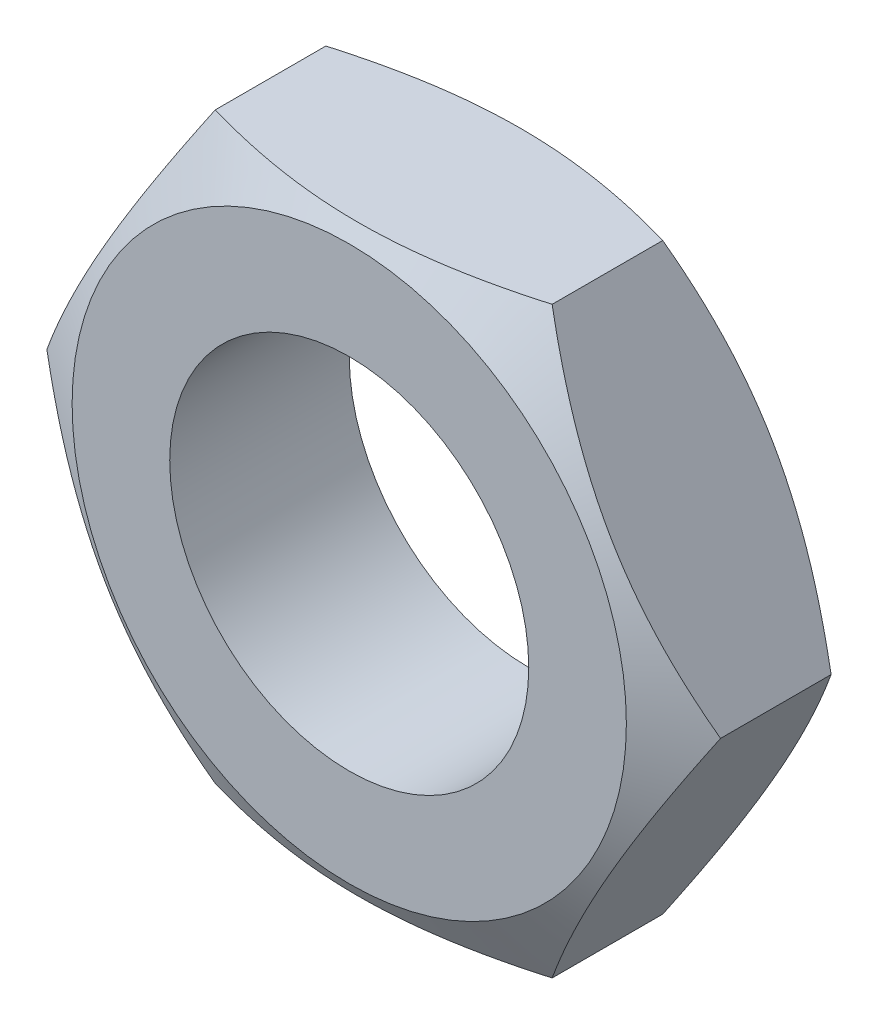
ISO-10303-21;
HEADER;
FILE_DESCRIPTION(('STEP AP214'),'2;1');
FILE_NAME('part.step','',(''),(''),'','','');
FILE_SCHEMA(('AUTOMOTIVE_DESIGN { 1 0 10303 214 1 1 1 1 }'));
ENDSEC;
DATA;
#1=APPLICATION_CONTEXT('core data for automotive mechanical design processes');
#2=APPLICATION_PROTOCOL_DEFINITION('international standard','automotive_design',2000,#1);
#3=PRODUCT_CONTEXT('',#1,'mechanical');
#4=PRODUCT('Part','Part','',(#3));
#5=PRODUCT_RELATED_PRODUCT_CATEGORY('part','',(#4));
#6=PRODUCT_DEFINITION_FORMATION('','',#4);
#7=PRODUCT_DEFINITION_CONTEXT('part definition',#1,'design');
#8=PRODUCT_DEFINITION('design','',#6,#7);
#9=PRODUCT_DEFINITION_SHAPE('','',#8);
#10=(LENGTH_UNIT() NAMED_UNIT(*) SI_UNIT(.MILLI.,.METRE.));
#11=(NAMED_UNIT(*) PLANE_ANGLE_UNIT() SI_UNIT($,.RADIAN.));
#12=(NAMED_UNIT(*) SI_UNIT($,.STERADIAN.) SOLID_ANGLE_UNIT());
#13=UNCERTAINTY_MEASURE_WITH_UNIT(LENGTH_MEASURE(1.E-05),#10,'distance_accuracy_value','');
#14=(GEOMETRIC_REPRESENTATION_CONTEXT(3) GLOBAL_UNCERTAINTY_ASSIGNED_CONTEXT((#13)) GLOBAL_UNIT_ASSIGNED_CONTEXT((#10,
#11,#12)) REPRESENTATION_CONTEXT('',''));
#15=CARTESIAN_POINT('',(0.,0.,0.));
#16=DIRECTION('',(0.,0.,1.));
#17=DIRECTION('',(1.,0.,0.));
#18=AXIS2_PLACEMENT_3D('',#15,#16,#17);
#19=CARTESIAN_POINT('',(7.50555349946513,0.,-4.));
#20=DIRECTION('',(0.866025403784439,0.5,0.));
#21=DIRECTION('',(-0.5,0.866025403784439,0.));
#22=AXIS2_PLACEMENT_3D('',#19,#20,#21);
#23=PLANE('',#22);
#24=CARTESIAN_POINT('',(7.50566896951897,-0.000199999999997443,-0.768262089292493));
#25=CARTESIAN_POINT('',(7.4231786300702,0.142677459058883,-0.720643260562112));
#26=CARTESIAN_POINT('',(7.34038072665458,0.286087634534915,-0.675185538089332));
#27=CARTESIAN_POINT('',(7.17411251123975,0.574072631317197,-0.589187519509672));
#28=CARTESIAN_POINT('',(7.09064192560665,0.718647926571266,-0.548649344714651));
#29=CARTESIAN_POINT('',(6.83889369625718,1.15468865052004,-0.435209838609835));
#30=CARTESIAN_POINT('',(6.6696223151608,1.44787528284632,-0.370686644615366));
#31=CARTESIAN_POINT('',(6.41631077211555,1.88662374554438,-0.295025421034118));
#32=CARTESIAN_POINT('',(6.33302748139454,2.03087463649469,-0.273471693943614));
#33=CARTESIAN_POINT('',(6.16608458377293,2.32002821713809,-0.237329152092746));
#34=CARTESIAN_POINT('',(6.08242501078143,2.46493084809889,-0.222739721946293));
#35=CARTESIAN_POINT('',(5.91496056339806,2.75498777942832,-0.200897589993974));
#36=CARTESIAN_POINT('',(5.8311559625217,2.90014160605421,-0.193636561808735));
#37=CARTESIAN_POINT('',(5.66347396979287,3.19057533697495,-0.186599140068859));
#38=CARTESIAN_POINT('',(5.5795965802691,3.33585523723636,-0.186822515298832));
#39=CARTESIAN_POINT('',(5.34979921898453,3.7338759424265,-0.197722296001793));
#40=CARTESIAN_POINT('',(5.20395446807007,3.98648646102757,-0.216020655356041));
#41=CARTESIAN_POINT('',(4.91323365606636,4.49002967823568,-0.274045178944302));
#42=CARTESIAN_POINT('',(4.76835861741226,4.74096060593308,-0.313791176024872));
#43=CARTESIAN_POINT('',(4.47705272008732,5.24551722064432,-0.413144740688777));
#44=CARTESIAN_POINT('',(4.33065861912703,5.49907924143591,-0.473173263124654));
#45=CARTESIAN_POINT('',(4.04005357906494,6.00242193575905,-0.609413829996496));
#46=CARTESIAN_POINT('',(3.89583891821182,6.25220905555296,-0.68559387165022));
#47=CARTESIAN_POINT('',(3.75266127967873,6.5002,-0.768262089292495));
#48=B_SPLINE_CURVE_WITH_KNOTS('',3,(#24,#25,#26,#27,#28,#29,#30,#31,#32,#33,#34,#35,#36,#37,#38,
#39,#40,#41,#42,#43,#44,#45,#46,#47),.UNSPECIFIED.,.F.,.F.,(4,2,2,2,2,2,2,2,2,2,2,4),(0.,
0.515105052395587,1.03043143507524,2.06322554824262,2.56697389547996,3.07067772176453,
3.57380860368928,4.0769239424252,4.9527935470566,5.82947446853466,6.72559912449736,
7.61996451221045),.UNSPECIFIED.);
#49=CARTESIAN_POINT('',(7.50555349946513,0.,-0.768195421087389));
#50=VERTEX_POINT('',#49);
#51=CARTESIAN_POINT('',(3.75277674973257,6.5,-0.76819542108739));
#52=VERTEX_POINT('',#51);
#53=EDGE_CURVE('E52',#50,#52,#48,.T.);
#54=ORIENTED_EDGE('',*,*,#53,.F.);
#55=DIRECTION('',(0.,0.,1.));
#56=VECTOR('',#55,1.);
#57=CARTESIAN_POINT('',(7.50555349946513,0.,-4.));
#58=LINE('',#57,#56);
#59=CARTESIAN_POINT('',(7.50555349946513,0.,-3.23180457891261));
#60=VERTEX_POINT('',#59);
#61=EDGE_CURVE('E12',#60,#50,#58,.T.);
#62=ORIENTED_EDGE('',*,*,#61,.F.);
#63=CARTESIAN_POINT('',(7.50566896951897,-0.000199999999997472,-3.23173791070751));
#64=CARTESIAN_POINT('',(7.4231786300702,0.142677459058883,-3.27935673943789));
#65=CARTESIAN_POINT('',(7.34038072665458,0.286087634534915,-3.32481446191067));
#66=CARTESIAN_POINT('',(7.17411251123975,0.574072631317197,-3.41081248049033));
#67=CARTESIAN_POINT('',(7.09064192560665,0.718647926571266,-3.45135065528535));
#68=CARTESIAN_POINT('',(6.83889369625719,1.15468865052004,-3.56479016139017));
#69=CARTESIAN_POINT('',(6.6696223151608,1.44787528284632,-3.62931335538463));
#70=CARTESIAN_POINT('',(6.41631077211555,1.88662374554438,-3.70497457896588));
#71=CARTESIAN_POINT('',(6.33302748139454,2.03087463649469,-3.72652830605639));
#72=CARTESIAN_POINT('',(6.16608458377293,2.32002821713809,-3.76267084790725));
#73=CARTESIAN_POINT('',(6.08242501078143,2.46493084809889,-3.77726027805371));
#74=CARTESIAN_POINT('',(5.91496056339806,2.75498777942832,-3.79910241000603));
#75=CARTESIAN_POINT('',(5.8311559625217,2.90014160605421,-3.80636343819126));
#76=CARTESIAN_POINT('',(5.66347396979287,3.19057533697495,-3.81340085993114));
#77=CARTESIAN_POINT('',(5.5795965802691,3.33585523723636,-3.81317748470117));
#78=CARTESIAN_POINT('',(5.34979921898453,3.7338759424265,-3.80227770399821));
#79=CARTESIAN_POINT('',(5.20395446807007,3.98648646102757,-3.78397934464396));
#80=CARTESIAN_POINT('',(4.91323365606636,4.49002967823568,-3.7259548210557));
#81=CARTESIAN_POINT('',(4.76835861741226,4.74096060593308,-3.68620882397513));
#82=CARTESIAN_POINT('',(4.47705272008732,5.24551722064432,-3.58685525931122));
#83=CARTESIAN_POINT('',(4.33065861912703,5.49907924143591,-3.52682673687535));
#84=CARTESIAN_POINT('',(4.04005357906494,6.00242193575905,-3.3905861700035));
#85=CARTESIAN_POINT('',(3.89583891821181,6.25220905555296,-3.31440612834978));
#86=CARTESIAN_POINT('',(3.75266127967873,6.5002,-3.23173791070751));
#87=B_SPLINE_CURVE_WITH_KNOTS('',3,(#63,#64,#65,#66,#67,#68,#69,#70,#71,#72,#73,#74,#75,#76,#77,
#78,#79,#80,#81,#82,#83,#84,#85,#86),.UNSPECIFIED.,.F.,.F.,(4,2,2,2,2,2,2,2,2,2,2,4),(0.,
0.515105052395587,1.03043143507524,2.06322554824262,2.56697389547996,3.07067772176454,
3.57380860368928,4.0769239424252,4.9527935470566,5.82947446853466,6.72559912449736,
7.61996451221045),.UNSPECIFIED.);
#88=CARTESIAN_POINT('',(3.75277674973257,6.5,-3.23180457891261));
#89=VERTEX_POINT('',#88);
#90=EDGE_CURVE('E121',#60,#89,#87,.T.);
#91=ORIENTED_EDGE('',*,*,#90,.T.);
#92=DIRECTION('',(0.,0.,1.));
#93=VECTOR('',#92,1.);
#94=CARTESIAN_POINT('',(3.75277674973257,6.5,-4.));
#95=LINE('',#94,#93);
#96=EDGE_CURVE('E39',#89,#52,#95,.T.);
#97=ORIENTED_EDGE('',*,*,#96,.T.);
#98=EDGE_LOOP('',(#54,#62,#91,#97));
#99=FACE_BOUND('',#98,.T.);
#100=ADVANCED_FACE('F35',(#99),#23,.T.);
#101=CARTESIAN_POINT('',(3.75277674973257,-6.5,-4.));
#102=DIRECTION('',(0.866025403784439,-0.5,0.));
#103=DIRECTION('',(0.5,0.866025403784439,0.));
#104=AXIS2_PLACEMENT_3D('',#101,#102,#103);
#105=PLANE('',#104);
#106=CARTESIAN_POINT('',(3.75266127967873,-6.5002,-0.768262089292495));
#107=CARTESIAN_POINT('',(3.8351516191275,-6.35732254094112,-0.720643260562113));
#108=CARTESIAN_POINT('',(3.91794952254312,-6.21391236546509,-0.675185538089333));
#109=CARTESIAN_POINT('',(4.08421773795795,-5.9259273686828,-0.589187519509673));
#110=CARTESIAN_POINT('',(4.16768832359105,-5.78135207342874,-0.548649344714652));
#111=CARTESIAN_POINT('',(4.41943655294051,-5.34531134947996,-0.435209838609835));
#112=CARTESIAN_POINT('',(4.5887079340369,-5.05212471715368,-0.370686644615366));
#113=CARTESIAN_POINT('',(4.84201947708215,-4.61337625445563,-0.295025421034118));
#114=CARTESIAN_POINT('',(4.92530276780316,-4.46912536350531,-0.273471693943614));
#115=CARTESIAN_POINT('',(5.09224566542477,-4.17997178286191,-0.237329152092746));
#116=CARTESIAN_POINT('',(5.17590523841627,-4.03506915190111,-0.222739721946293));
#117=CARTESIAN_POINT('',(5.34336968579964,-3.74501222057168,-0.200897589993973));
#118=CARTESIAN_POINT('',(5.427174286676,-3.59985839394579,-0.193636561808734));
#119=CARTESIAN_POINT('',(5.59485627940483,-3.30942466302505,-0.186599140068858));
#120=CARTESIAN_POINT('',(5.6787336689286,-3.16414476276364,-0.186822515298831));
#121=CARTESIAN_POINT('',(5.90853103021317,-2.76612405757351,-0.197722296001791));
#122=CARTESIAN_POINT('',(6.05437578112763,-2.51351353897243,-0.21602065535604));
#123=CARTESIAN_POINT('',(6.34509659313134,-2.00997032176432,-0.274045178944302));
#124=CARTESIAN_POINT('',(6.48997163178544,-1.75903939406692,-0.313791176024871));
#125=CARTESIAN_POINT('',(6.78127752911038,-1.25448277935568,-0.413144740688775));
#126=CARTESIAN_POINT('',(6.92767163007067,-1.00092075856408,-0.473173263124652));
#127=CARTESIAN_POINT('',(7.21827667013276,-0.497578064240953,-0.609413829996494));
#128=CARTESIAN_POINT('',(7.36249133098589,-0.247790944447033,-0.685593871650218));
#129=CARTESIAN_POINT('',(7.50566896951897,0.000200000000002478,-0.768262089292493));
#130=B_SPLINE_CURVE_WITH_KNOTS('',3,(#106,#107,#108,#109,#110,#111,#112,#113,#114,#115,#116,
#117,#118,#119,#120,#121,#122,#123,#124,#125,#126,#127,#128,#129),.UNSPECIFIED.,.F.,.F.,(4,2,2,
2,2,2,2,2,2,2,2,4),(0.,0.515105052395588,1.03043143507525,2.06322554824262,2.56697389547996,
3.07067772176454,3.57380860368928,4.0769239424252,4.9527935470566,5.82947446853466,
6.72559912449736,7.61996451221046),.UNSPECIFIED.);
#131=CARTESIAN_POINT('',(3.75277674973257,-6.5,-0.76819542108739));
#132=VERTEX_POINT('',#131);
#133=EDGE_CURVE('E188',#132,#50,#130,.T.);
#134=ORIENTED_EDGE('',*,*,#133,.F.);
#135=DIRECTION('',(0.,0.,1.));
#136=VECTOR('',#135,1.);
#137=CARTESIAN_POINT('',(3.75277674973257,-6.5,-4.));
#138=LINE('',#137,#136);
#139=CARTESIAN_POINT('',(3.75277674973257,-6.5,-3.23180457891261));
#140=VERTEX_POINT('',#139);
#141=EDGE_CURVE('E44',#140,#132,#138,.T.);
#142=ORIENTED_EDGE('',*,*,#141,.F.);
#143=CARTESIAN_POINT('',(3.75266127967873,-6.5002,-3.23173791070751));
#144=CARTESIAN_POINT('',(3.8351516191275,-6.35732254094112,-3.27935673943789));
#145=CARTESIAN_POINT('',(3.91794952254312,-6.21391236546509,-3.32481446191067));
#146=CARTESIAN_POINT('',(4.08421773795795,-5.9259273686828,-3.41081248049033));
#147=CARTESIAN_POINT('',(4.16768832359105,-5.78135207342874,-3.45135065528535));
#148=CARTESIAN_POINT('',(4.41943655294051,-5.34531134947996,-3.56479016139017));
#149=CARTESIAN_POINT('',(4.5887079340369,-5.05212471715368,-3.62931335538463));
#150=CARTESIAN_POINT('',(4.84201947708215,-4.61337625445563,-3.70497457896588));
#151=CARTESIAN_POINT('',(4.92530276780316,-4.46912536350531,-3.72652830605639));
#152=CARTESIAN_POINT('',(5.09224566542477,-4.17997178286191,-3.76267084790725));
#153=CARTESIAN_POINT('',(5.17590523841627,-4.03506915190111,-3.77726027805371));
#154=CARTESIAN_POINT('',(5.34336968579964,-3.74501222057168,-3.79910241000603));
#155=CARTESIAN_POINT('',(5.427174286676,-3.59985839394579,-3.80636343819127));
#156=CARTESIAN_POINT('',(5.59485627940483,-3.30942466302505,-3.81340085993114));
#157=CARTESIAN_POINT('',(5.6787336689286,-3.16414476276364,-3.81317748470117));
#158=CARTESIAN_POINT('',(5.90853103021317,-2.76612405757351,-3.80227770399821));
#159=CARTESIAN_POINT('',(6.05437578112763,-2.51351353897243,-3.78397934464396));
#160=CARTESIAN_POINT('',(6.34509659313134,-2.00997032176432,-3.7259548210557));
#161=CARTESIAN_POINT('',(6.48997163178544,-1.75903939406692,-3.68620882397513));
#162=CARTESIAN_POINT('',(6.78127752911038,-1.25448277935568,-3.58685525931122));
#163=CARTESIAN_POINT('',(6.92767163007067,-1.00092075856408,-3.52682673687535));
#164=CARTESIAN_POINT('',(7.21827667013276,-0.497578064240953,-3.39058617000351));
#165=CARTESIAN_POINT('',(7.36249133098589,-0.247790944447034,-3.31440612834978));
#166=CARTESIAN_POINT('',(7.50566896951897,0.00020000000000247,-3.23173791070751));
#167=B_SPLINE_CURVE_WITH_KNOTS('',3,(#143,#144,#145,#146,#147,#148,#149,#150,#151,#152,#153,
#154,#155,#156,#157,#158,#159,#160,#161,#162,#163,#164,#165,#166),.UNSPECIFIED.,.F.,.F.,(4,2,2,
2,2,2,2,2,2,2,2,4),(0.,0.515105052395588,1.03043143507525,2.06322554824262,2.56697389547996,
3.07067772176454,3.57380860368928,4.0769239424252,4.9527935470566,5.82947446853466,
6.72559912449736,7.61996451221046),.UNSPECIFIED.);
#168=EDGE_CURVE('E130',#140,#60,#167,.T.);
#169=ORIENTED_EDGE('',*,*,#168,.T.);
#170=ORIENTED_EDGE('',*,*,#61,.T.);
#171=EDGE_LOOP('',(#134,#142,#169,#170));
#172=FACE_BOUND('',#171,.T.);
#173=ADVANCED_FACE('F174',(#172),#105,.T.);
#174=CARTESIAN_POINT('',(3.75277674973257,-6.5,-4.));
#175=DIRECTION('',(0.,1.,0.));
#176=DIRECTION('',(0.,0.,1.));
#177=AXIS2_PLACEMENT_3D('',#174,#175,#176);
#178=PLANE('',#177);
#179=ORIENTED_EDGE('',*,*,#141,.T.);
#180=CARTESIAN_POINT('',(-10.0853375548736,-6.5,-3.36220004678138));
#181=CARTESIAN_POINT('',(-9.80134802812588,-6.5,-3.22441990697302));
#182=CARTESIAN_POINT('',(-9.51670700024681,-6.5,-3.08795964238411));
#183=CARTESIAN_POINT('',(-8.94577540318689,-6.5,-2.81842126641381));
#184=CARTESIAN_POINT('',(-8.65948458287684,-6.5,-2.68534368756637));
#185=CARTESIAN_POINT('',(-8.08343476578095,-6.5,-2.42264491119055));
#186=CARTESIAN_POINT('',(-7.79366537675803,-6.5,-2.29304642332339));
#187=CARTESIAN_POINT('',(-7.2118229699229,-6.5,-2.03914811596684));
#188=CARTESIAN_POINT('',(-6.91975006170902,-6.5,-1.91484804616671));
#189=CARTESIAN_POINT('',(-6.32349478620655,-6.5,-1.66909549127035));
#190=CARTESIAN_POINT('',(-6.01922275812393,-6.5,-1.5478593632889));
#191=CARTESIAN_POINT('',(-5.40712077894654,-6.5,-1.3145509145832));
#192=CARTESIAN_POINT('',(-5.09929043341956,-6.5,-1.20247962109837));
#193=CARTESIAN_POINT('',(-4.48015732909195,-6.5,-0.990438198875562));
#194=CARTESIAN_POINT('',(-4.1688630189811,-6.5,-0.890443643821411));
#195=CARTESIAN_POINT('',(-3.54180636990901,-6.5,-0.705761731284623));
#196=CARTESIAN_POINT('',(-3.22604546977722,-6.5,-0.62106956028275));
#197=CARTESIAN_POINT('',(-2.59159082188915,-6.5,-0.471486424178758));
#198=CARTESIAN_POINT('',(-2.27292205883991,-6.5,-0.406491181699719));
#199=CARTESIAN_POINT('',(-1.6315724932309,-6.5,-0.300006938955134));
#200=CARTESIAN_POINT('',(-1.30889209084447,-6.5,-0.258515613026437));
#201=CARTESIAN_POINT('',(-0.825292853681265,-6.5,-0.216661162175252));
#202=CARTESIAN_POINT('',(-0.665215688647255,-6.5,-0.206110841985603));
#203=CARTESIAN_POINT('',(-0.34475155598074,-6.5,-0.191783404083961));
#204=CARTESIAN_POINT('',(-0.184364593544543,-6.5,-0.188006173736132));
#205=CARTESIAN_POINT('',(0.136425092857907,-6.5,-0.187322534287352));
#206=CARTESIAN_POINT('',(0.296827816992843,-6.5,-0.19041620916424));
#207=CARTESIAN_POINT('',(0.617360663191906,-6.5,-0.20339684974841));
#208=CARTESIAN_POINT('',(0.777490771272894,-6.5,-0.213284153983385));
#209=CARTESIAN_POINT('',(1.16209350259518,-6.5,-0.244981682076412));
#210=CARTESIAN_POINT('',(1.38630708852548,-6.5,-0.270002049657741));
#211=CARTESIAN_POINT('',(1.8330636845727,-6.5,-0.331999672129688));
#212=CARTESIAN_POINT('',(2.05560646484965,-6.5,-0.368978542303749));
#213=CARTESIAN_POINT('',(2.72047029535186,-6.5,-0.495891457848702));
#214=CARTESIAN_POINT('',(3.15978587717356,-6.5,-0.601779328222846));
#215=CARTESIAN_POINT('',(3.81686500452624,-6.5,-0.785362223631732));
#216=CARTESIAN_POINT('',(4.03803471301364,-6.5,-0.851565853398221));
#217=CARTESIAN_POINT('',(4.47822491645402,-6.5,-0.990833101236593));
#218=CARTESIAN_POINT('',(4.69724539584356,-6.5,-1.06389676894435));
#219=CARTESIAN_POINT('',(5.13320878164558,-6.5,-1.21571279977335));
#220=CARTESIAN_POINT('',(5.35015233143427,-6.5,-1.29446333212734));
#221=CARTESIAN_POINT('',(5.78224049813256,-6.5,-1.45672784155227));
#222=CARTESIAN_POINT('',(5.99738514836343,-6.5,-1.54024173016575));
#223=CARTESIAN_POINT('',(6.55296757478944,-6.5,-1.76184923697059));
#224=CARTESIAN_POINT('',(6.89218885321257,-6.5,-1.90298901201028));
#225=CARTESIAN_POINT('',(7.56737458671902,-6.5,-2.19287986957649));
#226=CARTESIAN_POINT('',(7.90333874685312,-6.5,-2.34163163389092));
#227=CARTESIAN_POINT('',(8.57271559122067,-6.5,-2.64502788790477));
#228=CARTESIAN_POINT('',(8.90612743496948,-6.5,-2.79967422625777));
#229=CARTESIAN_POINT('',(9.57078232376478,-6.5,-3.11351822817407));
#230=CARTESIAN_POINT('',(9.90202543869404,-6.5,-3.27271574418918));
#231=CARTESIAN_POINT('',(10.5632125674915,-6.5,-3.59493645171037));
#232=CARTESIAN_POINT('',(10.8931541336183,-6.5,-3.75796465636144));
#233=CARTESIAN_POINT('',(11.5515881791099,-6.5,-4.08692181638442));
#234=CARTESIAN_POINT('',(11.8800806489109,-6.5,-4.25285079086543));
#235=CARTESIAN_POINT('',(12.863652105869,-6.5,-4.75407694075302));
#236=CARTESIAN_POINT('',(13.5169472382031,-6.5,-5.09287338954404));
#237=CARTESIAN_POINT('',(14.7562044490419,-6.5,-5.74321084222951));
#238=CARTESIAN_POINT('',(15.3424781267495,-6.5,-6.05416083272627));
#239=CARTESIAN_POINT('',(16.5130222774433,-6.5,-6.67987729180918));
#240=CARTESIAN_POINT('',(17.0972926475377,-6.5,-6.99464395276513));
#241=CARTESIAN_POINT('',(18.2625548960962,-6.5,-7.62608647197328));
#242=CARTESIAN_POINT('',(18.843551357978,-6.5,-7.94275388512238));
#243=CARTESIAN_POINT('',(20.0042886041877,-6.5,-8.57828927825012));
#244=CARTESIAN_POINT('',(20.58402947123,-6.5,-8.89715710709754));
#245=CARTESIAN_POINT('',(21.1633224873347,-6.5,-9.21683140267734));
#246=B_SPLINE_CURVE_WITH_KNOTS('',3,(#180,#181,#182,#183,#184,#185,#186,#187,#188,#189,#190,
#191,#192,#193,#194,#195,#196,#197,#198,#199,#200,#201,#202,#203,#204,#205,#206,#207,#208,#209,
#210,#211,#212,#213,#214,#215,#216,#217,#218,#219,#220,#221,#222,#223,#224,#225,#226,#227,#228,
#229,#230,#231,#232,#233,#234,#235,#236,#237,#238,#239,#240,#241,#242,#243,#244,#245),
.UNSPECIFIED.,.F.,.F.,(4,2,2,2,2,2,2,2,2,2,2,2,2,2,2,2,2,2,2,2,2,2,2,2,2,2,2,2,2,2,2,2,4),(0.,
0.946954411676652,1.89405698985574,2.84630576084279,3.79850949520577,4.78100275736423,
5.76360599165939,6.74418730016436,7.72445961787981,8.69944778189904,9.67433945602969,
10.1554913236188,10.6366351896241,11.1177849363167,11.5989586605209,12.2753928447356,
12.9519184358488,14.3056923752822,14.9982315866343,15.6907758092467,16.3830980671791,
17.0754074725912,18.1775082724094,19.2797079581629,20.3822562062884,21.4847687504869,
22.5888147783743,23.692868082014,25.900566540106,27.8914463851272,29.8824269960971,
31.8674953104379,33.8524286149959),.UNSPECIFIED.);
#247=CARTESIAN_POINT('',(-3.75277674973257,-6.5,-0.76819542108739));
#248=VERTEX_POINT('',#247);
#249=EDGE_CURVE('E181',#132,#248,#246,.F.);
#250=ORIENTED_EDGE('',*,*,#249,.T.);
#251=DIRECTION('',(0.,0.,1.));
#252=VECTOR('',#251,1.);
#253=CARTESIAN_POINT('',(-3.75277674973257,-6.5,-4.));
#254=LINE('',#253,#252);
#255=CARTESIAN_POINT('',(-3.75277674973257,-6.5,-3.23180457891261));
#256=VERTEX_POINT('',#255);
#257=EDGE_CURVE('E110',#256,#248,#254,.T.);
#258=ORIENTED_EDGE('',*,*,#257,.F.);
#259=CARTESIAN_POINT('',(-10.0984760385874,-6.5,-0.631422739220658));
#260=CARTESIAN_POINT('',(-9.81437610777456,-6.5,-0.769309181946903));
#261=CARTESIAN_POINT('',(-9.52962583266536,-6.5,-0.905878526255513));
#262=CARTESIAN_POINT('',(-8.95847872129702,-6.5,-1.17564244260662));
#263=CARTESIAN_POINT('',(-8.67208163556205,-6.5,-1.30883648586589));
#264=CARTESIAN_POINT('',(-8.09582867967822,-6.5,-1.57177517577268));
#265=CARTESIAN_POINT('',(-7.80596247970894,-6.5,-1.70149726155319));
#266=CARTESIAN_POINT('',(-7.2239302798293,-6.5,-1.95565523981818));
#267=CARTESIAN_POINT('',(-6.93176438894398,-6.5,-2.08009138113375));
#268=CARTESIAN_POINT('',(-6.33527283286663,-6.5,-2.32615796524242));
#269=CARTESIAN_POINT('',(-6.03085714059602,-6.5,-2.44757135495603));
#270=CARTESIAN_POINT('',(-5.41847100718217,-6.5,-2.68125265776585));
#271=CARTESIAN_POINT('',(-5.11050017266471,-6.5,-2.79351954751613));
#272=CARTESIAN_POINT('',(-4.49108507075382,-6.5,-3.0059749779181));
#273=CARTESIAN_POINT('',(-4.17964920936586,-6.5,-3.10618778584442));
#274=CARTESIAN_POINT('',(-3.55230737733536,-6.5,-3.29133069221321));
#275=CARTESIAN_POINT('',(-3.2364028419495,-6.5,-3.37626558259924));
#276=CARTESIAN_POINT('',(-2.60166259857333,-6.5,-3.52635352974854));
#277=CARTESIAN_POINT('',(-2.28285204623418,-6.5,-3.59161127500851));
#278=CARTESIAN_POINT('',(-1.64120333498363,-6.5,-3.69863456380733));
#279=CARTESIAN_POINT('',(-1.31836558204934,-6.5,-3.74040245607648));
#280=CARTESIAN_POINT('',(-0.834521103788977,-6.5,-3.7826644192406));
#281=CARTESIAN_POINT('',(-0.674364580762342,-6.5,-3.79334847609688));
#282=CARTESIAN_POINT('',(-0.353736118700878,-6.5,-3.80793912405159));
#283=CARTESIAN_POINT('',(-0.193264184974389,-6.5,-3.81184582825099));
#284=CARTESIAN_POINT('',(0.127700823218287,-6.5,-3.81278104463495));
#285=CARTESIAN_POINT('',(0.288193897911989,-6.5,-3.80980947549907));
#286=CARTESIAN_POINT('',(0.608912139280178,-6.5,-3.79706288068611));
#287=CARTESIAN_POINT('',(0.769137292305216,-6.5,-3.78728751837095));
#288=CARTESIAN_POINT('',(1.15357083620739,-6.5,-3.75587736197775));
#289=CARTESIAN_POINT('',(1.37752384534068,-6.5,-3.73104968784178));
#290=CARTESIAN_POINT('',(1.82376984675334,-6.5,-3.6694507779809));
#291=CARTESIAN_POINT('',(2.0460626122272,-6.5,-3.63267793989148));
#292=CARTESIAN_POINT('',(2.71018758626011,-6.5,-3.50639148184611));
#293=CARTESIAN_POINT('',(3.14902781108657,-6.5,-3.40093199990711));
#294=CARTESIAN_POINT('',(3.8054135045827,-6.5,-3.21798227254364));
#295=CARTESIAN_POINT('',(4.02635870902835,-6.5,-3.15198832977568));
#296=CARTESIAN_POINT('',(4.46610231645981,-6.5,-3.01313469310213));
#297=CARTESIAN_POINT('',(4.68490070379965,-6.5,-2.94027494919967));
#298=CARTESIAN_POINT('',(5.12042177597935,-6.5,-2.78886000592507));
#299=CARTESIAN_POINT('',(5.33714509655192,-6.5,-2.71030661850942));
#300=CARTESIAN_POINT('',(5.76879273671981,-6.5,-2.54843006303242));
#301=CARTESIAN_POINT('',(5.98371709049173,-6.5,-2.46510698582201));
#302=CARTESIAN_POINT('',(6.54157878623622,-6.5,-2.24285104234231));
#303=CARTESIAN_POINT('',(6.88326562264546,-6.5,-2.10078308701419));
#304=CARTESIAN_POINT('',(7.56333168240709,-6.5,-1.80891382033953));
#305=CARTESIAN_POINT('',(7.90171059850982,-6.5,-1.65911179859586));
#306=CARTESIAN_POINT('',(8.57588255735926,-6.5,-1.35353119576043));
#307=CARTESIAN_POINT('',(8.91167472795618,-6.5,-1.19775069649354));
#308=CARTESIAN_POINT('',(9.58106251704027,-6.5,-0.881582239841628));
#309=CARTESIAN_POINT('',(9.91465820824451,-6.5,-0.721194435939268));
#310=CARTESIAN_POINT('',(10.5805416857589,-6.5,-0.396548681062522));
#311=CARTESIAN_POINT('',(10.9128269551994,-6.5,-0.232285577616697));
#312=CARTESIAN_POINT('',(11.5759338967998,-6.5,0.0991690914742982));
#313=CARTESIAN_POINT('',(11.9067555590261,-6.5,0.266360676957196));
#314=CARTESIAN_POINT('',(12.8972952230478,-6.5,0.771401727981524));
#315=CARTESIAN_POINT('',(13.5552136713389,-6.5,1.11277937109712));
#316=CARTESIAN_POINT('',(14.8026473033125,-6.5,1.76775109852054));
#317=CARTESIAN_POINT('',(15.3924789467732,-6.5,2.0807452778263));
#318=CARTESIAN_POINT('',(16.570132395814,-6.5,2.71056286944535));
#319=CARTESIAN_POINT('',(17.1579540956598,-6.5,3.02738647934994));
#320=CARTESIAN_POINT('',(18.3302801173269,-6.5,3.66293017060064));
#321=CARTESIAN_POINT('',(18.9147890985797,-6.5,3.98164167048992));
#322=CARTESIAN_POINT('',(20.0825481011795,-6.5,4.6212681918676));
#323=CARTESIAN_POINT('',(20.6657982068144,-6.5,4.94218305940944));
#324=CARTESIAN_POINT('',(21.2486001146012,-6.5,5.26390474923412));
#325=B_SPLINE_CURVE_WITH_KNOTS('',3,(#259,#260,#261,#262,#263,#264,#265,#266,#267,#268,#269,
#270,#271,#272,#273,#274,#275,#276,#277,#278,#279,#280,#281,#282,#283,#284,#285,#286,#287,#288,
#289,#290,#291,#292,#293,#294,#295,#296,#297,#298,#299,#300,#301,#302,#303,#304,#305,#306,#307,
#308,#309,#310,#311,#312,#313,#314,#315,#316,#317,#318,#319,#320,#321,#322,#323,#324),
.UNSPECIFIED.,.F.,.F.,(4,2,2,2,2,2,2,2,2,2,2,2,2,2,2,2,2,2,2,2,2,2,2,2,2,2,2,2,2,2,2,2,4),(0.,
0.947391560556941,1.89493063563821,2.84759614797264,3.80021676462191,4.78330780417388,
5.76650868514644,6.74769582709539,7.72857467943604,8.70413893449324,9.67960562636464,
10.1610215018276,10.6424293433082,11.1238428764051,11.6052802305738,12.2808743182353,
12.9565590698127,14.3086443874997,15.0003577836093,15.6920762171751,16.3835754753282,
17.0750615664905,18.1850573283089,19.2951552285815,20.4056123277108,21.5160324771008,
22.628023008312,23.740021075135,25.9635967462184,27.9667797897405,29.9700666386944,
31.9673222122396,33.9644396319749),.UNSPECIFIED.);
#326=EDGE_CURVE('E165',#140,#256,#325,.F.);
#327=ORIENTED_EDGE('',*,*,#326,.F.);
#328=EDGE_LOOP('',(#179,#250,#258,#327));
#329=FACE_BOUND('',#328,.T.);
#330=ADVANCED_FACE('F170',(#329),#178,.F.);
#331=CARTESIAN_POINT('',(-7.50555349946513,0.,-4.));
#332=DIRECTION('',(-0.866025403784439,-0.5,0.));
#333=DIRECTION('',(0.5,-0.866025403784439,0.));
#334=AXIS2_PLACEMENT_3D('',#331,#332,#333);
#335=PLANE('',#334);
#336=CARTESIAN_POINT('',(-7.50566896951897,0.000200000000002634,-0.768262089292493));
#337=CARTESIAN_POINT('',(-7.4231786300702,-0.142677459058877,-0.720643260562111));
#338=CARTESIAN_POINT('',(-7.34038072665458,-0.28608763453491,-0.675185538089332));
#339=CARTESIAN_POINT('',(-7.17411251123975,-0.574072631317192,-0.589187519509672));
#340=CARTESIAN_POINT('',(-7.09064192560665,-0.718647926571261,-0.548649344714651));
#341=CARTESIAN_POINT('',(-6.83889369625719,-1.15468865052003,-0.435209838609835));
#342=CARTESIAN_POINT('',(-6.6696223151608,-1.44787528284632,-0.370686644615365));
#343=CARTESIAN_POINT('',(-6.41631077211555,-1.88662374554437,-0.295025421034117));
#344=CARTESIAN_POINT('',(-6.33302748139454,-2.03087463649469,-0.273471693943613));
#345=CARTESIAN_POINT('',(-6.16608458377293,-2.32002821713809,-0.237329152092745));
#346=CARTESIAN_POINT('',(-6.08242501078143,-2.46493084809889,-0.222739721946293));
#347=CARTESIAN_POINT('',(-5.91496056339806,-2.75498777942832,-0.200897589993973));
#348=CARTESIAN_POINT('',(-5.8311559625217,-2.90014160605421,-0.193636561808734));
#349=CARTESIAN_POINT('',(-5.66347396979287,-3.19057533697495,-0.186599140068858));
#350=CARTESIAN_POINT('',(-5.5795965802691,-3.33585523723636,-0.186822515298831));
#351=CARTESIAN_POINT('',(-5.34979921898453,-3.73387594242649,-0.197722296001792));
#352=CARTESIAN_POINT('',(-5.20395446807007,-3.98648646102757,-0.21602065535604));
#353=CARTESIAN_POINT('',(-4.91323365606635,-4.49002967823568,-0.274045178944301));
#354=CARTESIAN_POINT('',(-4.76835861741226,-4.74096060593308,-0.313791176024871));
#355=CARTESIAN_POINT('',(-4.47705272008732,-5.24551722064432,-0.413144740688776));
#356=CARTESIAN_POINT('',(-4.33065861912703,-5.49907924143591,-0.473173263124653));
#357=CARTESIAN_POINT('',(-4.04005357906494,-6.00242193575904,-0.609413829996496));
#358=CARTESIAN_POINT('',(-3.89583891821181,-6.25220905555296,-0.68559387165022));
#359=CARTESIAN_POINT('',(-3.75266127967873,-6.5002,-0.768262089292494));
#360=B_SPLINE_CURVE_WITH_KNOTS('',3,(#336,#337,#338,#339,#340,#341,#342,#343,#344,#345,#346,
#347,#348,#349,#350,#351,#352,#353,#354,#355,#356,#357,#358,#359),.UNSPECIFIED.,.F.,.F.,(4,2,2,
2,2,2,2,2,2,2,2,4),(0.,0.515105052395588,1.03043143507524,2.06322554824262,2.56697389547996,
3.07067772176454,3.57380860368928,4.0769239424252,4.9527935470566,5.82947446853466,
6.72559912449736,7.61996451221046),.UNSPECIFIED.);
#361=CARTESIAN_POINT('',(-7.50555349946513,0.,-0.768195421087388));
#362=VERTEX_POINT('',#361);
#363=EDGE_CURVE('E106',#362,#248,#360,.T.);
#364=ORIENTED_EDGE('',*,*,#363,.F.);
#365=DIRECTION('',(0.,0.,1.));
#366=VECTOR('',#365,1.);
#367=CARTESIAN_POINT('',(-7.50555349946513,0.,-4.));
#368=LINE('',#367,#366);
#369=CARTESIAN_POINT('',(-7.50555349946513,0.,-3.23180457891261));
#370=VERTEX_POINT('',#369);
#371=EDGE_CURVE('E105',#370,#362,#368,.T.);
#372=ORIENTED_EDGE('',*,*,#371,.F.);
#373=CARTESIAN_POINT('',(-7.50566896951897,0.000200000000002663,-3.23173791070751));
#374=CARTESIAN_POINT('',(-7.4231786300702,-0.142677459058878,-3.27935673943789));
#375=CARTESIAN_POINT('',(-7.34038072665458,-0.28608763453491,-3.32481446191067));
#376=CARTESIAN_POINT('',(-7.17411251123975,-0.574072631317192,-3.41081248049033));
#377=CARTESIAN_POINT('',(-7.09064192560665,-0.718647926571261,-3.45135065528535));
#378=CARTESIAN_POINT('',(-6.83889369625718,-1.15468865052003,-3.56479016139017));
#379=CARTESIAN_POINT('',(-6.6696223151608,-1.44787528284632,-3.62931335538463));
#380=CARTESIAN_POINT('',(-6.41631077211555,-1.88662374554437,-3.70497457896588));
#381=CARTESIAN_POINT('',(-6.33302748139454,-2.03087463649469,-3.72652830605639));
#382=CARTESIAN_POINT('',(-6.16608458377293,-2.32002821713809,-3.76267084790726));
#383=CARTESIAN_POINT('',(-6.08242501078143,-2.46493084809889,-3.77726027805371));
#384=CARTESIAN_POINT('',(-5.91496056339806,-2.75498777942832,-3.79910241000603));
#385=CARTESIAN_POINT('',(-5.8311559625217,-2.90014160605421,-3.80636343819127));
#386=CARTESIAN_POINT('',(-5.66347396979287,-3.19057533697495,-3.81340085993114));
#387=CARTESIAN_POINT('',(-5.5795965802691,-3.33585523723636,-3.81317748470117));
#388=CARTESIAN_POINT('',(-5.34979921898453,-3.73387594242649,-3.80227770399821));
#389=CARTESIAN_POINT('',(-5.20395446807007,-3.98648646102757,-3.78397934464396));
#390=CARTESIAN_POINT('',(-4.91323365606636,-4.49002967823568,-3.7259548210557));
#391=CARTESIAN_POINT('',(-4.76835861741226,-4.74096060593308,-3.68620882397513));
#392=CARTESIAN_POINT('',(-4.47705272008732,-5.24551722064432,-3.58685525931122));
#393=CARTESIAN_POINT('',(-4.33065861912703,-5.49907924143591,-3.52682673687535));
#394=CARTESIAN_POINT('',(-4.04005357906494,-6.00242193575904,-3.3905861700035));
#395=CARTESIAN_POINT('',(-3.89583891821181,-6.25220905555296,-3.31440612834978));
#396=CARTESIAN_POINT('',(-3.75266127967873,-6.5002,-3.23173791070751));
#397=B_SPLINE_CURVE_WITH_KNOTS('',3,(#373,#374,#375,#376,#377,#378,#379,#380,#381,#382,#383,
#384,#385,#386,#387,#388,#389,#390,#391,#392,#393,#394,#395,#396),.UNSPECIFIED.,.F.,.F.,(4,2,2,
2,2,2,2,2,2,2,2,4),(0.,0.515105052395588,1.03043143507524,2.06322554824262,2.56697389547996,
3.07067772176454,3.57380860368928,4.0769239424252,4.9527935470566,5.82947446853466,
6.72559912449736,7.61996451221046),.UNSPECIFIED.);
#398=EDGE_CURVE('E160',#370,#256,#397,.T.);
#399=ORIENTED_EDGE('',*,*,#398,.T.);
#400=ORIENTED_EDGE('',*,*,#257,.T.);
#401=EDGE_LOOP('',(#364,#372,#399,#400));
#402=FACE_BOUND('',#401,.T.);
#403=ADVANCED_FACE('F173',(#402),#335,.T.);
#404=CARTESIAN_POINT('',(-3.75277674973257,6.5,-4.));
#405=DIRECTION('',(-0.866025403784439,0.5,0.));
#406=DIRECTION('',(-0.5,-0.866025403784439,0.));
#407=AXIS2_PLACEMENT_3D('',#404,#405,#406);
#408=PLANE('',#407);
#409=CARTESIAN_POINT('',(-3.75266127967873,6.5002,-0.768262089292495));
#410=CARTESIAN_POINT('',(-3.8351516191275,6.35732254094112,-0.720643260562112));
#411=CARTESIAN_POINT('',(-3.91794952254312,6.21391236546509,-0.675185538089333));
#412=CARTESIAN_POINT('',(-4.08421773795795,5.9259273686828,-0.589187519509673));
#413=CARTESIAN_POINT('',(-4.16768832359105,5.78135207342874,-0.548649344714652));
#414=CARTESIAN_POINT('',(-4.41943655294051,5.34531134947997,-0.435209838609835));
#415=CARTESIAN_POINT('',(-4.5887079340369,5.05212471715368,-0.370686644615366));
#416=CARTESIAN_POINT('',(-4.84201947708215,4.61337625445563,-0.295025421034118));
#417=CARTESIAN_POINT('',(-4.92530276780316,4.46912536350531,-0.273471693943615));
#418=CARTESIAN_POINT('',(-5.09224566542477,4.17997178286191,-0.237329152092746));
#419=CARTESIAN_POINT('',(-5.17590523841627,4.03506915190111,-0.222739721946294));
#420=CARTESIAN_POINT('',(-5.34336968579964,3.74501222057168,-0.200897589993974));
#421=CARTESIAN_POINT('',(-5.427174286676,3.59985839394579,-0.193636561808735));
#422=CARTESIAN_POINT('',(-5.59485627940483,3.30942466302505,-0.186599140068858));
#423=CARTESIAN_POINT('',(-5.6787336689286,3.16414476276364,-0.186822515298831));
#424=CARTESIAN_POINT('',(-5.90853103021317,2.76612405757351,-0.197722296001792));
#425=CARTESIAN_POINT('',(-6.05437578112763,2.51351353897243,-0.21602065535604));
#426=CARTESIAN_POINT('',(-6.34509659313134,2.00997032176432,-0.274045178944302));
#427=CARTESIAN_POINT('',(-6.48997163178544,1.75903939406692,-0.313791176024871));
#428=CARTESIAN_POINT('',(-6.78127752911038,1.25448277935568,-0.413144740688776));
#429=CARTESIAN_POINT('',(-6.92767163007067,1.00092075856409,-0.473173263124653));
#430=CARTESIAN_POINT('',(-7.21827667013276,0.497578064240957,-0.609413829996494));
#431=CARTESIAN_POINT('',(-7.36249133098588,0.247790944447039,-0.685593871650218));
#432=CARTESIAN_POINT('',(-7.50566896951897,-0.000199999999997451,-0.768262089292493));
#433=B_SPLINE_CURVE_WITH_KNOTS('',3,(#409,#410,#411,#412,#413,#414,#415,#416,#417,#418,#419,
#420,#421,#422,#423,#424,#425,#426,#427,#428,#429,#430,#431,#432),.UNSPECIFIED.,.F.,.F.,(4,2,2,
2,2,2,2,2,2,2,2,4),(0.,0.515105052395589,1.03043143507525,2.06322554824262,2.56697389547996,
3.07067772176454,3.57380860368928,4.0769239424252,4.9527935470566,5.82947446853466,
6.72559912449736,7.61996451221045),.UNSPECIFIED.);
#434=CARTESIAN_POINT('',(-3.75277674973257,6.5,-0.76819542108739));
#435=VERTEX_POINT('',#434);
#436=EDGE_CURVE('E91',#435,#362,#433,.T.);
#437=ORIENTED_EDGE('',*,*,#436,.F.);
#438=DIRECTION('',(0.,0.,1.));
#439=VECTOR('',#438,1.);
#440=CARTESIAN_POINT('',(-3.75277674973257,6.5,-4.));
#441=LINE('',#440,#439);
#442=CARTESIAN_POINT('',(-3.75277674973257,6.5,-3.23180457891261));
#443=VERTEX_POINT('',#442);
#444=EDGE_CURVE('E103',#443,#435,#441,.T.);
#445=ORIENTED_EDGE('',*,*,#444,.F.);
#446=CARTESIAN_POINT('',(-3.75266127967873,6.5002,-3.23173791070751));
#447=CARTESIAN_POINT('',(-3.8351516191275,6.35732254094112,-3.27935673943789));
#448=CARTESIAN_POINT('',(-3.91794952254312,6.21391236546509,-3.32481446191067));
#449=CARTESIAN_POINT('',(-4.08421773795795,5.92592736868281,-3.41081248049033));
#450=CARTESIAN_POINT('',(-4.16768832359105,5.78135207342874,-3.45135065528535));
#451=CARTESIAN_POINT('',(-4.41943655294051,5.34531134947997,-3.56479016139016));
#452=CARTESIAN_POINT('',(-4.58870793403689,5.05212471715368,-3.62931335538463));
#453=CARTESIAN_POINT('',(-4.84201947708215,4.61337625445563,-3.70497457896588));
#454=CARTESIAN_POINT('',(-4.92530276780316,4.46912536350531,-3.72652830605639));
#455=CARTESIAN_POINT('',(-5.09224566542477,4.17997178286191,-3.76267084790725));
#456=CARTESIAN_POINT('',(-5.17590523841627,4.03506915190111,-3.77726027805371));
#457=CARTESIAN_POINT('',(-5.34336968579964,3.74501222057168,-3.79910241000603));
#458=CARTESIAN_POINT('',(-5.427174286676,3.59985839394579,-3.80636343819127));
#459=CARTESIAN_POINT('',(-5.59485627940483,3.30942466302505,-3.81340085993114));
#460=CARTESIAN_POINT('',(-5.6787336689286,3.16414476276364,-3.81317748470117));
#461=CARTESIAN_POINT('',(-5.90853103021317,2.76612405757351,-3.80227770399821));
#462=CARTESIAN_POINT('',(-6.05437578112763,2.51351353897243,-3.78397934464396));
#463=CARTESIAN_POINT('',(-6.34509659313134,2.00997032176432,-3.7259548210557));
#464=CARTESIAN_POINT('',(-6.48997163178544,1.75903939406692,-3.68620882397513));
#465=CARTESIAN_POINT('',(-6.78127752911038,1.25448277935568,-3.58685525931122));
#466=CARTESIAN_POINT('',(-6.92767163007067,1.00092075856409,-3.52682673687535));
#467=CARTESIAN_POINT('',(-7.21827667013276,0.497578064240957,-3.39058617000351));
#468=CARTESIAN_POINT('',(-7.36249133098588,0.247790944447038,-3.31440612834978));
#469=CARTESIAN_POINT('',(-7.50566896951897,-0.000199999999997245,-3.23173791070751));
#470=B_SPLINE_CURVE_WITH_KNOTS('',3,(#446,#447,#448,#449,#450,#451,#452,#453,#454,#455,#456,
#457,#458,#459,#460,#461,#462,#463,#464,#465,#466,#467,#468,#469),.UNSPECIFIED.,.F.,.F.,(4,2,2,
2,2,2,2,2,2,2,2,4),(0.,0.515105052395587,1.03043143507524,2.06322554824262,2.56697389547996,
3.07067772176454,3.57380860368928,4.0769239424252,4.9527935470566,5.82947446853466,
6.72559912449736,7.61996451221045),.UNSPECIFIED.);
#471=EDGE_CURVE('E60',#443,#370,#470,.T.);
#472=ORIENTED_EDGE('',*,*,#471,.T.);
#473=ORIENTED_EDGE('',*,*,#371,.T.);
#474=EDGE_LOOP('',(#437,#445,#472,#473));
#475=FACE_BOUND('',#474,.T.);
#476=ADVANCED_FACE('F102',(#475),#408,.T.);
#477=CARTESIAN_POINT('',(3.75277674973257,6.5,-4.));
#478=DIRECTION('',(0.,1.,0.));
#479=DIRECTION('',(0.,0.,1.));
#480=AXIS2_PLACEMENT_3D('',#477,#478,#479);
#481=PLANE('',#480);
#482=CARTESIAN_POINT('',(-10.0853375548736,6.5,-3.36220004678138));
#483=CARTESIAN_POINT('',(-9.80134802812588,6.5,-3.22441990697302));
#484=CARTESIAN_POINT('',(-9.51670700024681,6.5,-3.08795964238411));
#485=CARTESIAN_POINT('',(-8.94577540318689,6.5,-2.81842126641381));
#486=CARTESIAN_POINT('',(-8.65948458287684,6.5,-2.68534368756637));
#487=CARTESIAN_POINT('',(-8.08343476578095,6.5,-2.42264491119055));
#488=CARTESIAN_POINT('',(-7.79366537675803,6.5,-2.29304642332339));
#489=CARTESIAN_POINT('',(-7.2118229699229,6.5,-2.03914811596684));
#490=CARTESIAN_POINT('',(-6.91975006170902,6.5,-1.91484804616671));
#491=CARTESIAN_POINT('',(-6.32349478620655,6.5,-1.66909549127035));
#492=CARTESIAN_POINT('',(-6.01922275812393,6.5,-1.5478593632889));
#493=CARTESIAN_POINT('',(-5.40712077894654,6.5,-1.3145509145832));
#494=CARTESIAN_POINT('',(-5.09929043341956,6.5,-1.20247962109837));
#495=CARTESIAN_POINT('',(-4.48015732909195,6.5,-0.990438198875562));
#496=CARTESIAN_POINT('',(-4.1688630189811,6.5,-0.890443643821411));
#497=CARTESIAN_POINT('',(-3.54180636990901,6.5,-0.705761731284623));
#498=CARTESIAN_POINT('',(-3.22604546977722,6.5,-0.62106956028275));
#499=CARTESIAN_POINT('',(-2.59159082188915,6.5,-0.471486424178758));
#500=CARTESIAN_POINT('',(-2.27292205883991,6.5,-0.406491181699719));
#501=CARTESIAN_POINT('',(-1.6315724932309,6.5,-0.300006938955134));
#502=CARTESIAN_POINT('',(-1.30889209084447,6.5,-0.258515613026437));
#503=CARTESIAN_POINT('',(-0.825292853681265,6.5,-0.216661162175252));
#504=CARTESIAN_POINT('',(-0.665215688647255,6.5,-0.206110841985603));
#505=CARTESIAN_POINT('',(-0.34475155598074,6.5,-0.191783404083961));
#506=CARTESIAN_POINT('',(-0.184364593544543,6.5,-0.188006173736132));
#507=CARTESIAN_POINT('',(0.136425092857907,6.5,-0.187322534287352));
#508=CARTESIAN_POINT('',(0.296827816992843,6.5,-0.19041620916424));
#509=CARTESIAN_POINT('',(0.617360663191906,6.5,-0.20339684974841));
#510=CARTESIAN_POINT('',(0.777490771272894,6.5,-0.213284153983385));
#511=CARTESIAN_POINT('',(1.16209350259518,6.5,-0.244981682076412));
#512=CARTESIAN_POINT('',(1.38630708852548,6.5,-0.270002049657741));
#513=CARTESIAN_POINT('',(1.8330636845727,6.5,-0.331999672129688));
#514=CARTESIAN_POINT('',(2.05560646484965,6.5,-0.368978542303749));
#515=CARTESIAN_POINT('',(2.72047029535186,6.5,-0.495891457848702));
#516=CARTESIAN_POINT('',(3.15978587717356,6.5,-0.601779328222846));
#517=CARTESIAN_POINT('',(3.81686500452624,6.5,-0.785362223631732));
#518=CARTESIAN_POINT('',(4.03803471301364,6.5,-0.851565853398221));
#519=CARTESIAN_POINT('',(4.47822491645402,6.5,-0.990833101236593));
#520=CARTESIAN_POINT('',(4.69724539584356,6.5,-1.06389676894435));
#521=CARTESIAN_POINT('',(5.13320878164558,6.5,-1.21571279977335));
#522=CARTESIAN_POINT('',(5.35015233143427,6.5,-1.29446333212734));
#523=CARTESIAN_POINT('',(5.78224049813256,6.5,-1.45672784155227));
#524=CARTESIAN_POINT('',(5.99738514836343,6.5,-1.54024173016575));
#525=CARTESIAN_POINT('',(6.55296757478944,6.5,-1.76184923697059));
#526=CARTESIAN_POINT('',(6.89218885321257,6.5,-1.90298901201028));
#527=CARTESIAN_POINT('',(7.56737458671902,6.5,-2.19287986957649));
#528=CARTESIAN_POINT('',(7.90333874685312,6.5,-2.34163163389092));
#529=CARTESIAN_POINT('',(8.57271559122067,6.5,-2.64502788790477));
#530=CARTESIAN_POINT('',(8.90612743496948,6.5,-2.79967422625777));
#531=CARTESIAN_POINT('',(9.57078232376478,6.5,-3.11351822817407));
#532=CARTESIAN_POINT('',(9.90202543869404,6.5,-3.27271574418918));
#533=CARTESIAN_POINT('',(10.5632125674915,6.5,-3.59493645171037));
#534=CARTESIAN_POINT('',(10.8931541336183,6.5,-3.75796465636144));
#535=CARTESIAN_POINT('',(11.5515881791099,6.5,-4.08692181638442));
#536=CARTESIAN_POINT('',(11.8800806489109,6.5,-4.25285079086543));
#537=CARTESIAN_POINT('',(12.863652105869,6.5,-4.75407694075302));
#538=CARTESIAN_POINT('',(13.5169472382031,6.5,-5.09287338954404));
#539=CARTESIAN_POINT('',(14.7562044490419,6.5,-5.74321084222951));
#540=CARTESIAN_POINT('',(15.3424781267495,6.5,-6.05416083272627));
#541=CARTESIAN_POINT('',(16.5130222774433,6.5,-6.67987729180918));
#542=CARTESIAN_POINT('',(17.0972926475377,6.5,-6.99464395276513));
#543=CARTESIAN_POINT('',(18.2625548960962,6.5,-7.62608647197328));
#544=CARTESIAN_POINT('',(18.843551357978,6.5,-7.94275388512238));
#545=CARTESIAN_POINT('',(20.0042886041877,6.5,-8.57828927825012));
#546=CARTESIAN_POINT('',(20.58402947123,6.5,-8.89715710709754));
#547=CARTESIAN_POINT('',(21.1633224873347,6.5,-9.21683140267734));
#548=B_SPLINE_CURVE_WITH_KNOTS('',3,(#482,#483,#484,#485,#486,#487,#488,#489,#490,#491,#492,
#493,#494,#495,#496,#497,#498,#499,#500,#501,#502,#503,#504,#505,#506,#507,#508,#509,#510,#511,
#512,#513,#514,#515,#516,#517,#518,#519,#520,#521,#522,#523,#524,#525,#526,#527,#528,#529,#530,
#531,#532,#533,#534,#535,#536,#537,#538,#539,#540,#541,#542,#543,#544,#545,#546,#547),
.UNSPECIFIED.,.F.,.F.,(4,2,2,2,2,2,2,2,2,2,2,2,2,2,2,2,2,2,2,2,2,2,2,2,2,2,2,2,2,2,2,2,4),(0.,
0.946954411676652,1.89405698985574,2.84630576084279,3.79850949520577,4.78100275736423,
5.76360599165939,6.74418730016436,7.72445961787981,8.69944778189904,9.67433945602969,
10.1554913236188,10.6366351896241,11.1177849363167,11.5989586605209,12.2753928447356,
12.9519184358488,14.3056923752822,14.9982315866343,15.6907758092467,16.3830980671791,
17.0754074725912,18.1775082724094,19.2797079581629,20.3822562062884,21.4847687504869,
22.5888147783743,23.692868082014,25.900566540106,27.8914463851272,29.8824269960971,
31.8674953104379,33.8524286149959),.UNSPECIFIED.);
#549=EDGE_CURVE('E87',#52,#435,#548,.F.);
#550=ORIENTED_EDGE('',*,*,#549,.F.);
#551=ORIENTED_EDGE('',*,*,#96,.F.);
#552=CARTESIAN_POINT('',(-10.0984760385874,6.5,-0.631422739220658));
#553=CARTESIAN_POINT('',(-9.81437610777456,6.5,-0.769309181946903));
#554=CARTESIAN_POINT('',(-9.52962583266536,6.5,-0.905878526255513));
#555=CARTESIAN_POINT('',(-8.95847872129702,6.5,-1.17564244260662));
#556=CARTESIAN_POINT('',(-8.67208163556205,6.5,-1.30883648586589));
#557=CARTESIAN_POINT('',(-8.09582867967822,6.5,-1.57177517577268));
#558=CARTESIAN_POINT('',(-7.80596247970894,6.5,-1.70149726155319));
#559=CARTESIAN_POINT('',(-7.2239302798293,6.5,-1.95565523981818));
#560=CARTESIAN_POINT('',(-6.93176438894398,6.5,-2.08009138113375));
#561=CARTESIAN_POINT('',(-6.33527283286663,6.5,-2.32615796524242));
#562=CARTESIAN_POINT('',(-6.03085714059602,6.5,-2.44757135495603));
#563=CARTESIAN_POINT('',(-5.41847100718217,6.5,-2.68125265776585));
#564=CARTESIAN_POINT('',(-5.11050017266471,6.5,-2.79351954751613));
#565=CARTESIAN_POINT('',(-4.49108507075382,6.5,-3.0059749779181));
#566=CARTESIAN_POINT('',(-4.17964920936586,6.5,-3.10618778584442));
#567=CARTESIAN_POINT('',(-3.55230737733536,6.5,-3.29133069221321));
#568=CARTESIAN_POINT('',(-3.2364028419495,6.5,-3.37626558259924));
#569=CARTESIAN_POINT('',(-2.60166259857333,6.5,-3.52635352974854));
#570=CARTESIAN_POINT('',(-2.28285204623418,6.5,-3.59161127500851));
#571=CARTESIAN_POINT('',(-1.64120333498363,6.5,-3.69863456380733));
#572=CARTESIAN_POINT('',(-1.31836558204934,6.5,-3.74040245607648));
#573=CARTESIAN_POINT('',(-0.834521103788977,6.5,-3.7826644192406));
#574=CARTESIAN_POINT('',(-0.674364580762342,6.5,-3.79334847609688));
#575=CARTESIAN_POINT('',(-0.353736118700878,6.5,-3.80793912405159));
#576=CARTESIAN_POINT('',(-0.193264184974389,6.5,-3.81184582825099));
#577=CARTESIAN_POINT('',(0.127700823218287,6.5,-3.81278104463495));
#578=CARTESIAN_POINT('',(0.288193897911989,6.5,-3.80980947549907));
#579=CARTESIAN_POINT('',(0.608912139280178,6.5,-3.79706288068611));
#580=CARTESIAN_POINT('',(0.769137292305216,6.5,-3.78728751837095));
#581=CARTESIAN_POINT('',(1.15357083620739,6.5,-3.75587736197775));
#582=CARTESIAN_POINT('',(1.37752384534068,6.5,-3.73104968784178));
#583=CARTESIAN_POINT('',(1.82376984675334,6.5,-3.6694507779809));
#584=CARTESIAN_POINT('',(2.0460626122272,6.5,-3.63267793989148));
#585=CARTESIAN_POINT('',(2.71018758626011,6.5,-3.50639148184611));
#586=CARTESIAN_POINT('',(3.14902781108657,6.5,-3.40093199990711));
#587=CARTESIAN_POINT('',(3.8054135045827,6.5,-3.21798227254364));
#588=CARTESIAN_POINT('',(4.02635870902835,6.5,-3.15198832977568));
#589=CARTESIAN_POINT('',(4.46610231645981,6.5,-3.01313469310213));
#590=CARTESIAN_POINT('',(4.68490070379965,6.5,-2.94027494919967));
#591=CARTESIAN_POINT('',(5.12042177597935,6.5,-2.78886000592507));
#592=CARTESIAN_POINT('',(5.33714509655192,6.5,-2.71030661850942));
#593=CARTESIAN_POINT('',(5.76879273671981,6.5,-2.54843006303242));
#594=CARTESIAN_POINT('',(5.98371709049173,6.5,-2.46510698582201));
#595=CARTESIAN_POINT('',(6.54157878623622,6.5,-2.24285104234231));
#596=CARTESIAN_POINT('',(6.88326562264546,6.5,-2.10078308701419));
#597=CARTESIAN_POINT('',(7.56333168240709,6.5,-1.80891382033953));
#598=CARTESIAN_POINT('',(7.90171059850982,6.5,-1.65911179859586));
#599=CARTESIAN_POINT('',(8.57588255735926,6.5,-1.35353119576043));
#600=CARTESIAN_POINT('',(8.91167472795618,6.5,-1.19775069649354));
#601=CARTESIAN_POINT('',(9.58106251704027,6.5,-0.881582239841628));
#602=CARTESIAN_POINT('',(9.91465820824451,6.5,-0.721194435939268));
#603=CARTESIAN_POINT('',(10.5805416857589,6.5,-0.396548681062522));
#604=CARTESIAN_POINT('',(10.9128269551994,6.5,-0.232285577616697));
#605=CARTESIAN_POINT('',(11.5759338967998,6.5,0.0991690914742982));
#606=CARTESIAN_POINT('',(11.9067555590261,6.5,0.266360676957196));
#607=CARTESIAN_POINT('',(12.8972952230478,6.5,0.771401727981524));
#608=CARTESIAN_POINT('',(13.5552136713389,6.5,1.11277937109712));
#609=CARTESIAN_POINT('',(14.8026473033125,6.5,1.76775109852054));
#610=CARTESIAN_POINT('',(15.3924789467732,6.5,2.0807452778263));
#611=CARTESIAN_POINT('',(16.570132395814,6.5,2.71056286944535));
#612=CARTESIAN_POINT('',(17.1579540956598,6.5,3.02738647934994));
#613=CARTESIAN_POINT('',(18.3302801173269,6.5,3.66293017060064));
#614=CARTESIAN_POINT('',(18.9147890985797,6.5,3.98164167048992));
#615=CARTESIAN_POINT('',(20.0825481011795,6.5,4.6212681918676));
#616=CARTESIAN_POINT('',(20.6657982068144,6.5,4.94218305940944));
#617=CARTESIAN_POINT('',(21.2486001146012,6.5,5.26390474923412));
#618=B_SPLINE_CURVE_WITH_KNOTS('',3,(#552,#553,#554,#555,#556,#557,#558,#559,#560,#561,#562,
#563,#564,#565,#566,#567,#568,#569,#570,#571,#572,#573,#574,#575,#576,#577,#578,#579,#580,#581,
#582,#583,#584,#585,#586,#587,#588,#589,#590,#591,#592,#593,#594,#595,#596,#597,#598,#599,#600,
#601,#602,#603,#604,#605,#606,#607,#608,#609,#610,#611,#612,#613,#614,#615,#616,#617),
.UNSPECIFIED.,.F.,.F.,(4,2,2,2,2,2,2,2,2,2,2,2,2,2,2,2,2,2,2,2,2,2,2,2,2,2,2,2,2,2,2,2,4),(0.,
0.947391560556941,1.89493063563821,2.84759614797264,3.80021676462191,4.78330780417388,
5.76650868514644,6.74769582709539,7.72857467943604,8.70413893449324,9.67960562636464,
10.1610215018276,10.6424293433082,11.1238428764051,11.6052802305738,12.2808743182353,
12.9565590698127,14.3086443874997,15.0003577836093,15.6920762171751,16.3835754753282,
17.0750615664905,18.1850573283089,19.2951552285815,20.4056123277108,21.5160324771008,
22.628023008312,23.740021075135,25.9635967462184,27.9667797897405,29.9700666386944,
31.9673222122396,33.9644396319749),.UNSPECIFIED.);
#619=EDGE_CURVE('E109',#89,#443,#618,.F.);
#620=ORIENTED_EDGE('',*,*,#619,.T.);
#621=ORIENTED_EDGE('',*,*,#444,.T.);
#622=EDGE_LOOP('',(#550,#551,#620,#621));
#623=FACE_BOUND('',#622,.T.);
#624=ADVANCED_FACE('F108',(#623),#481,.T.);
#625=CARTESIAN_POINT('',(3.75277674973257,6.5,-4.));
#626=DIRECTION('',(0.,0.,1.));
#627=DIRECTION('',(1.,0.,0.));
#628=AXIS2_PLACEMENT_3D('',#625,#626,#627);
#629=PLANE('',#628);
#630=CARTESIAN_POINT('',(0.,0.,-4.));
#631=DIRECTION('',(0.,0.,1.));
#632=DIRECTION('',(1.,0.,0.));
#633=AXIS2_PLACEMENT_3D('',#630,#631,#632);
#634=CIRCLE('',#633,4.);
#635=CARTESIAN_POINT('',(4.,0.,-4.));
#636=VERTEX_POINT('',#635);
#637=EDGE_CURVE('E112',#636,#636,#634,.T.);
#638=ORIENTED_EDGE('',*,*,#637,.T.);
#639=EDGE_LOOP('',(#638));
#640=FACE_BOUND('',#639,.T.);
#641=CARTESIAN_POINT('',(0.,0.,-4.));
#642=DIRECTION('',(0.,0.,-1.));
#643=DIRECTION('',(-1.,0.,0.));
#644=AXIS2_PLACEMENT_3D('',#641,#642,#643);
#645=CIRCLE('',#644,6.175);
#646=CARTESIAN_POINT('',(-6.175,0.,-4.));
#647=VERTEX_POINT('',#646);
#648=EDGE_CURVE('E199',#647,#647,#645,.T.);
#649=ORIENTED_EDGE('',*,*,#648,.T.);
#650=EDGE_LOOP('',(#649));
#651=FACE_BOUND('',#650,.T.);
#652=ADVANCED_FACE('F240',(#640,#651),#629,.F.);
#653=CARTESIAN_POINT('',(3.75277674973257,6.5,0.));
#654=DIRECTION('',(0.,0.,1.));
#655=DIRECTION('',(1.,0.,0.));
#656=AXIS2_PLACEMENT_3D('',#653,#654,#655);
#657=PLANE('',#656);
#658=CARTESIAN_POINT('',(0.,0.,0.));
#659=DIRECTION('',(0.,0.,-1.));
#660=DIRECTION('',(-1.,0.,0.));
#661=AXIS2_PLACEMENT_3D('',#658,#659,#660);
#662=CIRCLE('',#661,6.175);
#663=CARTESIAN_POINT('',(-6.175,0.,0.));
#664=VERTEX_POINT('',#663);
#665=EDGE_CURVE('E97',#664,#664,#662,.T.);
#666=ORIENTED_EDGE('',*,*,#665,.F.);
#667=EDGE_LOOP('',(#666));
#668=FACE_BOUND('',#667,.T.);
#669=CARTESIAN_POINT('',(0.,0.,0.));
#670=DIRECTION('',(0.,0.,1.));
#671=DIRECTION('',(1.,0.,0.));
#672=AXIS2_PLACEMENT_3D('',#669,#670,#671);
#673=CIRCLE('',#672,4.);
#674=CARTESIAN_POINT('',(4.,0.,0.));
#675=VERTEX_POINT('',#674);
#676=EDGE_CURVE('E118',#675,#675,#673,.T.);
#677=ORIENTED_EDGE('',*,*,#676,.F.);
#678=EDGE_LOOP('',(#677));
#679=FACE_BOUND('',#678,.T.);
#680=ADVANCED_FACE('F247',(#668,#679),#657,.T.);
#681=CARTESIAN_POINT('',(0.,0.,-4.));
#682=DIRECTION('',(0.,0.,1.));
#683=DIRECTION('',(1.,0.,0.));
#684=AXIS2_PLACEMENT_3D('',#681,#682,#683);
#685=CYLINDRICAL_SURFACE('',#684,4.);
#686=ORIENTED_EDGE('',*,*,#637,.F.);
#687=EDGE_LOOP('',(#686));
#688=FACE_BOUND('',#687,.T.);
#689=ORIENTED_EDGE('',*,*,#676,.T.);
#690=EDGE_LOOP('',(#689));
#691=FACE_BOUND('',#690,.T.);
#692=ADVANCED_FACE('F141',(#688,#691),#685,.F.);
#693=CARTESIAN_POINT('',(0.,0.,-4.));
#694=DIRECTION('',(0.,0.,1.));
#695=DIRECTION('',(-1.,0.,0.));
#696=AXIS2_PLACEMENT_3D('',#693,#694,#695);
#697=CONICAL_SURFACE('',#696,6.175,1.0471975511966);
#698=ORIENTED_EDGE('',*,*,#168,.F.);
#699=ORIENTED_EDGE('',*,*,#326,.T.);
#700=ORIENTED_EDGE('',*,*,#398,.F.);
#701=ORIENTED_EDGE('',*,*,#471,.F.);
#702=ORIENTED_EDGE('',*,*,#619,.F.);
#703=ORIENTED_EDGE('',*,*,#90,.F.);
#704=EDGE_LOOP('',(#698,#699,#700,#701,#702,#703));
#705=FACE_BOUND('',#704,.T.);
#706=ORIENTED_EDGE('',*,*,#648,.F.);
#707=EDGE_LOOP('',(#706));
#708=FACE_BOUND('',#707,.T.);
#709=ADVANCED_FACE('F136',(#705,#708),#697,.T.);
#710=CARTESIAN_POINT('',(0.,0.,0.));
#711=DIRECTION('',(0.,0.,-1.));
#712=DIRECTION('',(-1.,0.,0.));
#713=AXIS2_PLACEMENT_3D('',#710,#711,#712);
#714=CONICAL_SURFACE('',#713,6.175,1.0471975511966);
#715=ORIENTED_EDGE('',*,*,#53,.T.);
#716=ORIENTED_EDGE('',*,*,#549,.T.);
#717=ORIENTED_EDGE('',*,*,#436,.T.);
#718=ORIENTED_EDGE('',*,*,#363,.T.);
#719=ORIENTED_EDGE('',*,*,#249,.F.);
#720=ORIENTED_EDGE('',*,*,#133,.T.);
#721=EDGE_LOOP('',(#715,#716,#717,#718,#719,#720));
#722=FACE_BOUND('',#721,.T.);
#723=ORIENTED_EDGE('',*,*,#665,.T.);
#724=EDGE_LOOP('',(#723));
#725=FACE_BOUND('',#724,.T.);
#726=ADVANCED_FACE('F89',(#722,#725),#714,.T.);
#727=CLOSED_SHELL('',(#100,#173,#330,#403,#476,#624,#652,#680,#692,#709,#726));
#728=MANIFOLD_SOLID_BREP('B2',#727);
#729=ADVANCED_BREP_SHAPE_REPRESENTATION('',(#18,#728),#14);
#730=SHAPE_DEFINITION_REPRESENTATION(#9,#729);
ENDSEC;
END-ISO-10303-21;
